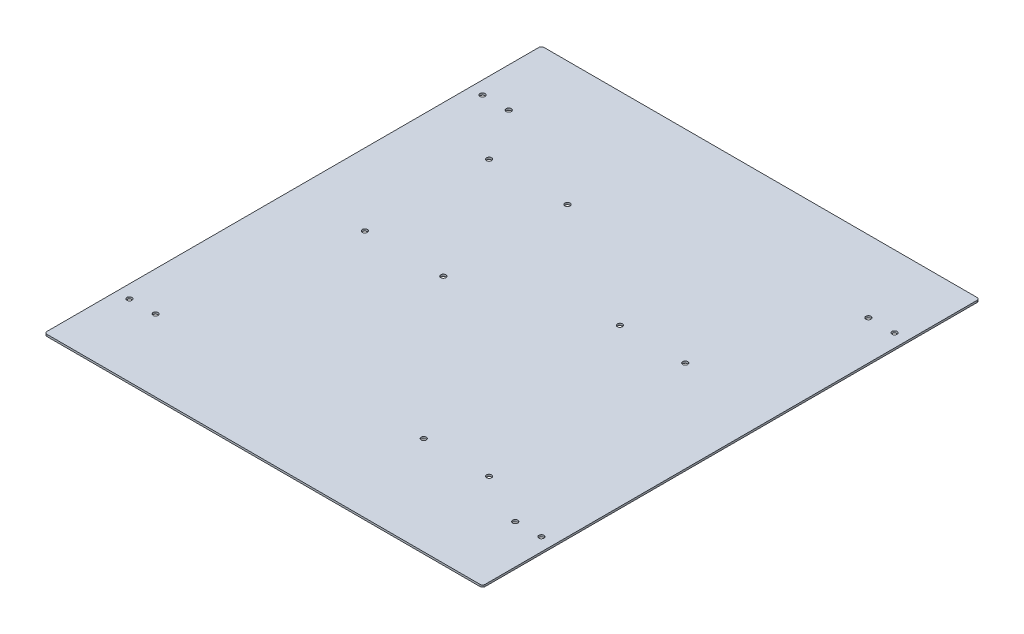
ISO-10303-21;
HEADER;
FILE_DESCRIPTION(('STEP AP214'),'2;1');
FILE_NAME('part.step','',(''),(''),'','','');
FILE_SCHEMA(('AUTOMOTIVE_DESIGN { 1 0 10303 214 1 1 1 1 }'));
ENDSEC;
DATA;
#1=APPLICATION_CONTEXT('core data for automotive mechanical design processes');
#2=APPLICATION_PROTOCOL_DEFINITION('international standard','automotive_design',2000,#1);
#3=PRODUCT_CONTEXT('',#1,'mechanical');
#4=PRODUCT('Part','Part','',(#3));
#5=PRODUCT_RELATED_PRODUCT_CATEGORY('part','',(#4));
#6=PRODUCT_DEFINITION_FORMATION('','',#4);
#7=PRODUCT_DEFINITION_CONTEXT('part definition',#1,'design');
#8=PRODUCT_DEFINITION('design','',#6,#7);
#9=PRODUCT_DEFINITION_SHAPE('','',#8);
#10=(LENGTH_UNIT() NAMED_UNIT(*) SI_UNIT(.MILLI.,.METRE.));
#11=(NAMED_UNIT(*) PLANE_ANGLE_UNIT() SI_UNIT($,.RADIAN.));
#12=(NAMED_UNIT(*) SI_UNIT($,.STERADIAN.) SOLID_ANGLE_UNIT());
#13=UNCERTAINTY_MEASURE_WITH_UNIT(LENGTH_MEASURE(1.E-05),#10,'distance_accuracy_value','');
#14=(GEOMETRIC_REPRESENTATION_CONTEXT(3) GLOBAL_UNCERTAINTY_ASSIGNED_CONTEXT((#13)) GLOBAL_UNIT_ASSIGNED_CONTEXT((#10,
#11,#12)) REPRESENTATION_CONTEXT('',''));
#15=CARTESIAN_POINT('',(0.,0.,0.));
#16=DIRECTION('',(0.,0.,1.));
#17=DIRECTION('',(1.,0.,0.));
#18=AXIS2_PLACEMENT_3D('',#15,#16,#17);
#19=CARTESIAN_POINT('',(167.5,1.5,190.));
#20=DIRECTION('',(-1.,0.,0.));
#21=DIRECTION('',(0.,0.,1.));
#22=AXIS2_PLACEMENT_3D('',#19,#20,#21);
#23=PLANE('',#22);
#24=DIRECTION('',(0.,0.,-1.));
#25=VECTOR('',#24,1.);
#26=CARTESIAN_POINT('',(167.5,0.,190.));
#27=LINE('',#26,#25);
#28=CARTESIAN_POINT('',(167.5,0.,188.));
#29=VERTEX_POINT('',#28);
#30=CARTESIAN_POINT('',(167.5,0.,-188.));
#31=VERTEX_POINT('',#30);
#32=EDGE_CURVE('E128',#29,#31,#27,.T.);
#33=ORIENTED_EDGE('',*,*,#32,.T.);
#34=DIRECTION('',(0.,-1.,0.));
#35=VECTOR('',#34,1.);
#36=CARTESIAN_POINT('',(167.5,1.5,-188.));
#37=LINE('',#36,#35);
#38=CARTESIAN_POINT('',(167.5,1.5,-188.));
#39=VERTEX_POINT('',#38);
#40=EDGE_CURVE('E106',#31,#39,#37,.F.);
#41=ORIENTED_EDGE('',*,*,#40,.T.);
#42=DIRECTION('',(0.,0.,-1.));
#43=VECTOR('',#42,1.);
#44=CARTESIAN_POINT('',(167.5,1.5,190.));
#45=LINE('',#44,#43);
#46=CARTESIAN_POINT('',(167.5,1.5,188.));
#47=VERTEX_POINT('',#46);
#48=EDGE_CURVE('E138',#47,#39,#45,.T.);
#49=ORIENTED_EDGE('',*,*,#48,.F.);
#50=DIRECTION('',(0.,-1.,0.));
#51=VECTOR('',#50,1.);
#52=CARTESIAN_POINT('',(167.5,1.5,188.));
#53=LINE('',#52,#51);
#54=EDGE_CURVE('E111',#47,#29,#53,.T.);
#55=ORIENTED_EDGE('',*,*,#54,.T.);
#56=EDGE_LOOP('',(#33,#41,#49,#55));
#57=FACE_BOUND('',#56,.T.);
#58=ADVANCED_FACE('F35',(#57),#23,.F.);
#59=CARTESIAN_POINT('',(-167.5,1.5,-190.));
#60=DIRECTION('',(0.,0.,1.));
#61=DIRECTION('',(1.,0.,0.));
#62=AXIS2_PLACEMENT_3D('',#59,#60,#61);
#63=PLANE('',#62);
#64=DIRECTION('',(-1.,0.,0.));
#65=VECTOR('',#64,1.);
#66=CARTESIAN_POINT('',(-167.5,1.5,-190.));
#67=LINE('',#66,#65);
#68=CARTESIAN_POINT('',(165.5,1.5,-190.));
#69=VERTEX_POINT('',#68);
#70=CARTESIAN_POINT('',(-165.5,1.5,-190.));
#71=VERTEX_POINT('',#70);
#72=EDGE_CURVE('E121',#69,#71,#67,.T.);
#73=ORIENTED_EDGE('',*,*,#72,.F.);
#74=DIRECTION('',(0.,-1.,0.));
#75=VECTOR('',#74,1.);
#76=CARTESIAN_POINT('',(165.5,1.5,-190.));
#77=LINE('',#76,#75);
#78=CARTESIAN_POINT('',(165.5,0.,-190.));
#79=VERTEX_POINT('',#78);
#80=EDGE_CURVE('E105',#69,#79,#77,.T.);
#81=ORIENTED_EDGE('',*,*,#80,.T.);
#82=DIRECTION('',(-1.,0.,0.));
#83=VECTOR('',#82,1.);
#84=CARTESIAN_POINT('',(-167.5,0.,-190.));
#85=LINE('',#84,#83);
#86=CARTESIAN_POINT('',(-165.5,0.,-190.));
#87=VERTEX_POINT('',#86);
#88=EDGE_CURVE('E118',#79,#87,#85,.T.);
#89=ORIENTED_EDGE('',*,*,#88,.T.);
#90=DIRECTION('',(0.,-1.,0.));
#91=VECTOR('',#90,1.);
#92=CARTESIAN_POINT('',(-165.5,1.5,-190.));
#93=LINE('',#92,#91);
#94=EDGE_CURVE('E123',#87,#71,#93,.F.);
#95=ORIENTED_EDGE('',*,*,#94,.T.);
#96=EDGE_LOOP('',(#73,#81,#89,#95));
#97=FACE_BOUND('',#96,.T.);
#98=ADVANCED_FACE('F117',(#97),#63,.F.);
#99=CARTESIAN_POINT('',(-167.5,1.5,190.));
#100=DIRECTION('',(1.,0.,0.));
#101=DIRECTION('',(0.,0.,-1.));
#102=AXIS2_PLACEMENT_3D('',#99,#100,#101);
#103=PLANE('',#102);
#104=DIRECTION('',(0.,0.,1.));
#105=VECTOR('',#104,1.);
#106=CARTESIAN_POINT('',(-167.5,0.,190.));
#107=LINE('',#106,#105);
#108=CARTESIAN_POINT('',(-167.5,0.,-188.));
#109=VERTEX_POINT('',#108);
#110=CARTESIAN_POINT('',(-167.5,0.,188.));
#111=VERTEX_POINT('',#110);
#112=EDGE_CURVE('E127',#109,#111,#107,.T.);
#113=ORIENTED_EDGE('',*,*,#112,.T.);
#114=DIRECTION('',(0.,-1.,0.));
#115=VECTOR('',#114,1.);
#116=CARTESIAN_POINT('',(-167.5,1.5,188.));
#117=LINE('',#116,#115);
#118=CARTESIAN_POINT('',(-167.5,1.5,188.));
#119=VERTEX_POINT('',#118);
#120=EDGE_CURVE('E11',#111,#119,#117,.F.);
#121=ORIENTED_EDGE('',*,*,#120,.T.);
#122=DIRECTION('',(0.,0.,1.));
#123=VECTOR('',#122,1.);
#124=CARTESIAN_POINT('',(-167.5,1.5,190.));
#125=LINE('',#124,#123);
#126=CARTESIAN_POINT('',(-167.5,1.5,-188.));
#127=VERTEX_POINT('',#126);
#128=EDGE_CURVE('E192',#127,#119,#125,.T.);
#129=ORIENTED_EDGE('',*,*,#128,.F.);
#130=DIRECTION('',(0.,-1.,0.));
#131=VECTOR('',#130,1.);
#132=CARTESIAN_POINT('',(-167.5,1.5,-188.));
#133=LINE('',#132,#131);
#134=EDGE_CURVE('E43',#127,#109,#133,.T.);
#135=ORIENTED_EDGE('',*,*,#134,.T.);
#136=EDGE_LOOP('',(#113,#121,#129,#135));
#137=FACE_BOUND('',#136,.T.);
#138=ADVANCED_FACE('F190',(#137),#103,.F.);
#139=CARTESIAN_POINT('',(-167.5,1.5,190.));
#140=DIRECTION('',(0.,0.,-1.));
#141=DIRECTION('',(-1.,0.,0.));
#142=AXIS2_PLACEMENT_3D('',#139,#140,#141);
#143=PLANE('',#142);
#144=DIRECTION('',(1.,0.,0.));
#145=VECTOR('',#144,1.);
#146=CARTESIAN_POINT('',(-167.5,0.,190.));
#147=LINE('',#146,#145);
#148=CARTESIAN_POINT('',(-165.5,0.,190.));
#149=VERTEX_POINT('',#148);
#150=CARTESIAN_POINT('',(165.5,0.,190.));
#151=VERTEX_POINT('',#150);
#152=EDGE_CURVE('E131',#149,#151,#147,.T.);
#153=ORIENTED_EDGE('',*,*,#152,.T.);
#154=DIRECTION('',(0.,-1.,0.));
#155=VECTOR('',#154,1.);
#156=CARTESIAN_POINT('',(165.5,1.5,190.));
#157=LINE('',#156,#155);
#158=CARTESIAN_POINT('',(165.5,1.5,190.));
#159=VERTEX_POINT('',#158);
#160=EDGE_CURVE('E50',#151,#159,#157,.F.);
#161=ORIENTED_EDGE('',*,*,#160,.T.);
#162=DIRECTION('',(1.,0.,0.));
#163=VECTOR('',#162,1.);
#164=CARTESIAN_POINT('',(-167.5,1.5,190.));
#165=LINE('',#164,#163);
#166=CARTESIAN_POINT('',(-165.5,1.5,190.));
#167=VERTEX_POINT('',#166);
#168=EDGE_CURVE('E167',#167,#159,#165,.T.);
#169=ORIENTED_EDGE('',*,*,#168,.F.);
#170=DIRECTION('',(0.,-1.,0.));
#171=VECTOR('',#170,1.);
#172=CARTESIAN_POINT('',(-165.5,1.5,190.));
#173=LINE('',#172,#171);
#174=EDGE_CURVE('E183',#167,#149,#173,.T.);
#175=ORIENTED_EDGE('',*,*,#174,.T.);
#176=EDGE_LOOP('',(#153,#161,#169,#175));
#177=FACE_BOUND('',#176,.T.);
#178=ADVANCED_FACE('F199',(#177),#143,.F.);
#179=CARTESIAN_POINT('',(0.,1.5,0.));
#180=DIRECTION('',(0.,-1.,0.));
#181=DIRECTION('',(0.,0.,-1.));
#182=AXIS2_PLACEMENT_3D('',#179,#180,#181);
#183=PLANE('',#182);
#184=CARTESIAN_POINT('',(-112.5,1.5,0.));
#185=DIRECTION('',(0.,1.,0.));
#186=DIRECTION('',(0.,0.,1.));
#187=AXIS2_PLACEMENT_3D('',#184,#185,#186);
#188=CIRCLE('',#187,1.95);
#189=CARTESIAN_POINT('',(-112.5,1.5,1.94999999999998));
#190=VERTEX_POINT('',#189);
#191=EDGE_CURVE('E265',#190,#190,#188,.T.);
#192=ORIENTED_EDGE('',*,*,#191,.F.);
#193=EDGE_LOOP('',(#192));
#194=FACE_BOUND('',#193,.T.);
#195=CARTESIAN_POINT('',(-52.5,1.5,0.));
#196=DIRECTION('',(0.,1.,0.));
#197=DIRECTION('',(0.,0.,1.));
#198=AXIS2_PLACEMENT_3D('',#195,#196,#197);
#199=CIRCLE('',#198,1.95);
#200=CARTESIAN_POINT('',(-52.5,1.5,1.94999999999999));
#201=VERTEX_POINT('',#200);
#202=EDGE_CURVE('E268',#201,#201,#199,.T.);
#203=ORIENTED_EDGE('',*,*,#202,.F.);
#204=EDGE_LOOP('',(#203));
#205=FACE_BOUND('',#204,.T.);
#206=CARTESIAN_POINT('',(-52.5,1.5,-95.));
#207=DIRECTION('',(0.,1.,0.));
#208=DIRECTION('',(0.,0.,1.));
#209=AXIS2_PLACEMENT_3D('',#206,#207,#208);
#210=CIRCLE('',#209,1.95);
#211=CARTESIAN_POINT('',(-52.5,1.5,-93.05));
#212=VERTEX_POINT('',#211);
#213=EDGE_CURVE('E264',#212,#212,#210,.T.);
#214=ORIENTED_EDGE('',*,*,#213,.F.);
#215=EDGE_LOOP('',(#214));
#216=FACE_BOUND('',#215,.T.);
#217=CARTESIAN_POINT('',(-112.5,1.5,-95.));
#218=DIRECTION('',(0.,1.,0.));
#219=DIRECTION('',(0.,0.,1.));
#220=AXIS2_PLACEMENT_3D('',#217,#218,#219);
#221=CIRCLE('',#220,1.95);
#222=CARTESIAN_POINT('',(-112.5,1.5,-93.05));
#223=VERTEX_POINT('',#222);
#224=EDGE_CURVE('E157',#223,#223,#221,.T.);
#225=ORIENTED_EDGE('',*,*,#224,.F.);
#226=EDGE_LOOP('',(#225));
#227=FACE_BOUND('',#226,.T.);
#228=CARTESIAN_POINT('',(47.5,1.5,-35.0000000000002));
#229=DIRECTION('',(0.,1.,0.));
#230=DIRECTION('',(0.,0.,1.));
#231=AXIS2_PLACEMENT_3D('',#228,#229,#230);
#232=CIRCLE('',#231,1.95);
#233=CARTESIAN_POINT('',(47.5,1.5,-33.0500000000002));
#234=VERTEX_POINT('',#233);
#235=EDGE_CURVE('E254',#234,#234,#232,.T.);
#236=ORIENTED_EDGE('',*,*,#235,.F.);
#237=EDGE_LOOP('',(#236));
#238=FACE_BOUND('',#237,.T.);
#239=CARTESIAN_POINT('',(97.5,1.5,115.));
#240=DIRECTION('',(0.,1.,0.));
#241=DIRECTION('',(0.,0.,1.));
#242=AXIS2_PLACEMENT_3D('',#239,#240,#241);
#243=CIRCLE('',#242,1.95000000000003);
#244=CARTESIAN_POINT('',(97.5,1.5,116.95));
#245=VERTEX_POINT('',#244);
#246=EDGE_CURVE('E255',#245,#245,#243,.T.);
#247=ORIENTED_EDGE('',*,*,#246,.F.);
#248=EDGE_LOOP('',(#247));
#249=FACE_BOUND('',#248,.T.);
#250=CARTESIAN_POINT('',(47.5,1.5,115.));
#251=DIRECTION('',(0.,1.,0.));
#252=DIRECTION('',(0.,0.,1.));
#253=AXIS2_PLACEMENT_3D('',#250,#251,#252);
#254=CIRCLE('',#253,1.95);
#255=CARTESIAN_POINT('',(47.5,1.5,116.95));
#256=VERTEX_POINT('',#255);
#257=EDGE_CURVE('E166',#256,#256,#254,.T.);
#258=ORIENTED_EDGE('',*,*,#257,.F.);
#259=EDGE_LOOP('',(#258));
#260=FACE_BOUND('',#259,.T.);
#261=CARTESIAN_POINT('',(97.5,1.5,-35.0000000000002));
#262=DIRECTION('',(0.,1.,0.));
#263=DIRECTION('',(0.,0.,1.));
#264=AXIS2_PLACEMENT_3D('',#261,#262,#263);
#265=CIRCLE('',#264,1.95);
#266=CARTESIAN_POINT('',(97.5,1.5,-33.0500000000002));
#267=VERTEX_POINT('',#266);
#268=EDGE_CURVE('E143',#267,#267,#265,.T.);
#269=ORIENTED_EDGE('',*,*,#268,.F.);
#270=EDGE_LOOP('',(#269));
#271=FACE_BOUND('',#270,.T.);
#272=CARTESIAN_POINT('',(157.5,1.5,-135.));
#273=DIRECTION('',(0.,-1.,0.));
#274=DIRECTION('',(0.,0.,-1.));
#275=AXIS2_PLACEMENT_3D('',#272,#273,#274);
#276=CIRCLE('',#275,1.95);
#277=CARTESIAN_POINT('',(157.5,1.5,-136.95));
#278=VERTEX_POINT('',#277);
#279=EDGE_CURVE('E133',#278,#278,#276,.T.);
#280=ORIENTED_EDGE('',*,*,#279,.T.);
#281=EDGE_LOOP('',(#280));
#282=FACE_BOUND('',#281,.T.);
#283=CARTESIAN_POINT('',(137.5,1.5,-135.));
#284=DIRECTION('',(0.,-1.,0.));
#285=DIRECTION('',(0.,0.,-1.));
#286=AXIS2_PLACEMENT_3D('',#283,#284,#285);
#287=CIRCLE('',#286,1.95);
#288=CARTESIAN_POINT('',(137.5,1.5,-136.95));
#289=VERTEX_POINT('',#288);
#290=EDGE_CURVE('E208',#289,#289,#287,.T.);
#291=ORIENTED_EDGE('',*,*,#290,.T.);
#292=EDGE_LOOP('',(#291));
#293=FACE_BOUND('',#292,.T.);
#294=CARTESIAN_POINT('',(157.5,1.5,135.));
#295=DIRECTION('',(0.,-1.,0.));
#296=DIRECTION('',(0.,0.,-1.));
#297=AXIS2_PLACEMENT_3D('',#294,#295,#296);
#298=CIRCLE('',#297,1.95);
#299=CARTESIAN_POINT('',(157.5,1.5,133.05));
#300=VERTEX_POINT('',#299);
#301=EDGE_CURVE('E211',#300,#300,#298,.T.);
#302=ORIENTED_EDGE('',*,*,#301,.T.);
#303=EDGE_LOOP('',(#302));
#304=FACE_BOUND('',#303,.T.);
#305=CARTESIAN_POINT('',(-157.5,1.5,135.));
#306=DIRECTION('',(0.,-1.,0.));
#307=DIRECTION('',(0.,0.,-1.));
#308=AXIS2_PLACEMENT_3D('',#305,#306,#307);
#309=CIRCLE('',#308,1.95);
#310=CARTESIAN_POINT('',(-157.5,1.5,133.05));
#311=VERTEX_POINT('',#310);
#312=EDGE_CURVE('E214',#311,#311,#309,.T.);
#313=ORIENTED_EDGE('',*,*,#312,.T.);
#314=EDGE_LOOP('',(#313));
#315=FACE_BOUND('',#314,.T.);
#316=CARTESIAN_POINT('',(-137.5,1.5,-135.));
#317=DIRECTION('',(0.,-1.,0.));
#318=DIRECTION('',(0.,0.,-1.));
#319=AXIS2_PLACEMENT_3D('',#316,#317,#318);
#320=CIRCLE('',#319,1.95);
#321=CARTESIAN_POINT('',(-137.5,1.5,-136.95));
#322=VERTEX_POINT('',#321);
#323=EDGE_CURVE('E217',#322,#322,#320,.T.);
#324=ORIENTED_EDGE('',*,*,#323,.T.);
#325=EDGE_LOOP('',(#324));
#326=FACE_BOUND('',#325,.T.);
#327=CARTESIAN_POINT('',(-157.5,1.5,-135.));
#328=DIRECTION('',(0.,-1.,0.));
#329=DIRECTION('',(0.,0.,-1.));
#330=AXIS2_PLACEMENT_3D('',#327,#328,#329);
#331=CIRCLE('',#330,1.95);
#332=CARTESIAN_POINT('',(-157.5,1.5,-136.95));
#333=VERTEX_POINT('',#332);
#334=EDGE_CURVE('E220',#333,#333,#331,.T.);
#335=ORIENTED_EDGE('',*,*,#334,.T.);
#336=EDGE_LOOP('',(#335));
#337=FACE_BOUND('',#336,.T.);
#338=CARTESIAN_POINT('',(-137.5,1.5,135.));
#339=DIRECTION('',(0.,-1.,0.));
#340=DIRECTION('',(0.,0.,-1.));
#341=AXIS2_PLACEMENT_3D('',#338,#339,#340);
#342=CIRCLE('',#341,1.95);
#343=CARTESIAN_POINT('',(-137.5,1.5,133.05));
#344=VERTEX_POINT('',#343);
#345=EDGE_CURVE('E223',#344,#344,#342,.T.);
#346=ORIENTED_EDGE('',*,*,#345,.T.);
#347=EDGE_LOOP('',(#346));
#348=FACE_BOUND('',#347,.T.);
#349=CARTESIAN_POINT('',(137.5,1.5,135.));
#350=DIRECTION('',(0.,-1.,0.));
#351=DIRECTION('',(0.,0.,-1.));
#352=AXIS2_PLACEMENT_3D('',#349,#350,#351);
#353=CIRCLE('',#352,1.95);
#354=CARTESIAN_POINT('',(137.5,1.5,133.05));
#355=VERTEX_POINT('',#354);
#356=EDGE_CURVE('E226',#355,#355,#353,.T.);
#357=ORIENTED_EDGE('',*,*,#356,.T.);
#358=EDGE_LOOP('',(#357));
#359=FACE_BOUND('',#358,.T.);
#360=ORIENTED_EDGE('',*,*,#48,.T.);
#361=CARTESIAN_POINT('',(165.5,1.5,-188.));
#362=DIRECTION('',(0.,-1.,0.));
#363=DIRECTION('',(0.,0.,-1.));
#364=AXIS2_PLACEMENT_3D('',#361,#362,#363);
#365=CIRCLE('',#364,2.);
#366=EDGE_CURVE('E181',#39,#69,#365,.F.);
#367=ORIENTED_EDGE('',*,*,#366,.T.);
#368=ORIENTED_EDGE('',*,*,#72,.T.);
#369=CARTESIAN_POINT('',(-165.5,1.5,-188.));
#370=DIRECTION('',(0.,-1.,0.));
#371=DIRECTION('',(0.,0.,-1.));
#372=AXIS2_PLACEMENT_3D('',#369,#370,#371);
#373=CIRCLE('',#372,2.);
#374=EDGE_CURVE('E176',#71,#127,#373,.F.);
#375=ORIENTED_EDGE('',*,*,#374,.T.);
#376=ORIENTED_EDGE('',*,*,#128,.T.);
#377=CARTESIAN_POINT('',(-165.5,1.5,188.));
#378=DIRECTION('',(0.,-1.,0.));
#379=DIRECTION('',(0.,0.,-1.));
#380=AXIS2_PLACEMENT_3D('',#377,#378,#379);
#381=CIRCLE('',#380,2.);
#382=EDGE_CURVE('E57',#119,#167,#381,.F.);
#383=ORIENTED_EDGE('',*,*,#382,.T.);
#384=ORIENTED_EDGE('',*,*,#168,.T.);
#385=CARTESIAN_POINT('',(165.5,1.5,188.));
#386=DIRECTION('',(0.,-1.,0.));
#387=DIRECTION('',(0.,0.,-1.));
#388=AXIS2_PLACEMENT_3D('',#385,#386,#387);
#389=CIRCLE('',#388,2.);
#390=EDGE_CURVE('E179',#159,#47,#389,.F.);
#391=ORIENTED_EDGE('',*,*,#390,.T.);
#392=EDGE_LOOP('',(#360,#367,#368,#375,#376,#383,#384,#391));
#393=FACE_BOUND('',#392,.T.);
#394=ADVANCED_FACE('F276',(#194,#205,#216,#227,#238,#249,#260,#271,#282,#293,#304,#315,#326,
#337,#348,#359,#393),#183,.F.);
#395=CARTESIAN_POINT('',(0.,0.,0.));
#396=DIRECTION('',(0.,-1.,0.));
#397=DIRECTION('',(0.,0.,-1.));
#398=AXIS2_PLACEMENT_3D('',#395,#396,#397);
#399=PLANE('',#398);
#400=CARTESIAN_POINT('',(-112.5,0.,0.));
#401=DIRECTION('',(0.,-1.,0.));
#402=DIRECTION('',(0.,0.,-1.));
#403=AXIS2_PLACEMENT_3D('',#400,#401,#402);
#404=CIRCLE('',#403,1.95);
#405=CARTESIAN_POINT('',(-112.5,0.,-1.95000000000001));
#406=VERTEX_POINT('',#405);
#407=EDGE_CURVE('E163',#406,#406,#404,.T.);
#408=ORIENTED_EDGE('',*,*,#407,.F.);
#409=EDGE_LOOP('',(#408));
#410=FACE_BOUND('',#409,.T.);
#411=CARTESIAN_POINT('',(-52.5,0.,0.));
#412=DIRECTION('',(0.,-1.,0.));
#413=DIRECTION('',(0.,0.,-1.));
#414=AXIS2_PLACEMENT_3D('',#411,#412,#413);
#415=CIRCLE('',#414,1.95);
#416=CARTESIAN_POINT('',(-52.5,0.,-1.95000000000001));
#417=VERTEX_POINT('',#416);
#418=EDGE_CURVE('E160',#417,#417,#415,.T.);
#419=ORIENTED_EDGE('',*,*,#418,.F.);
#420=EDGE_LOOP('',(#419));
#421=FACE_BOUND('',#420,.T.);
#422=CARTESIAN_POINT('',(-52.5,0.,-95.));
#423=DIRECTION('',(0.,-1.,0.));
#424=DIRECTION('',(0.,0.,-1.));
#425=AXIS2_PLACEMENT_3D('',#422,#423,#424);
#426=CIRCLE('',#425,1.95);
#427=CARTESIAN_POINT('',(-52.5,0.,-96.95));
#428=VERTEX_POINT('',#427);
#429=EDGE_CURVE('E156',#428,#428,#426,.T.);
#430=ORIENTED_EDGE('',*,*,#429,.F.);
#431=EDGE_LOOP('',(#430));
#432=FACE_BOUND('',#431,.T.);
#433=CARTESIAN_POINT('',(-112.5,0.,-95.));
#434=DIRECTION('',(0.,-1.,0.));
#435=DIRECTION('',(0.,0.,-1.));
#436=AXIS2_PLACEMENT_3D('',#433,#434,#435);
#437=CIRCLE('',#436,1.95);
#438=CARTESIAN_POINT('',(-112.5,0.,-96.95));
#439=VERTEX_POINT('',#438);
#440=EDGE_CURVE('E153',#439,#439,#437,.T.);
#441=ORIENTED_EDGE('',*,*,#440,.F.);
#442=EDGE_LOOP('',(#441));
#443=FACE_BOUND('',#442,.T.);
#444=CARTESIAN_POINT('',(47.5,0.,-35.0000000000002));
#445=DIRECTION('',(0.,-1.,0.));
#446=DIRECTION('',(0.,0.,-1.));
#447=AXIS2_PLACEMENT_3D('',#444,#445,#446);
#448=CIRCLE('',#447,1.95);
#449=CARTESIAN_POINT('',(47.5,0.,-36.9500000000002));
#450=VERTEX_POINT('',#449);
#451=EDGE_CURVE('E149',#450,#450,#448,.T.);
#452=ORIENTED_EDGE('',*,*,#451,.F.);
#453=EDGE_LOOP('',(#452));
#454=FACE_BOUND('',#453,.T.);
#455=CARTESIAN_POINT('',(97.5,0.,115.));
#456=DIRECTION('',(0.,-1.,0.));
#457=DIRECTION('',(0.,0.,-1.));
#458=AXIS2_PLACEMENT_3D('',#455,#456,#457);
#459=CIRCLE('',#458,1.95000000000003);
#460=CARTESIAN_POINT('',(97.5,0.,113.05));
#461=VERTEX_POINT('',#460);
#462=EDGE_CURVE('E146',#461,#461,#459,.T.);
#463=ORIENTED_EDGE('',*,*,#462,.F.);
#464=EDGE_LOOP('',(#463));
#465=FACE_BOUND('',#464,.T.);
#466=CARTESIAN_POINT('',(47.5,0.,115.));
#467=DIRECTION('',(0.,-1.,0.));
#468=DIRECTION('',(0.,0.,-1.));
#469=AXIS2_PLACEMENT_3D('',#466,#467,#468);
#470=CIRCLE('',#469,1.95);
#471=CARTESIAN_POINT('',(47.5,0.,113.05));
#472=VERTEX_POINT('',#471);
#473=EDGE_CURVE('E142',#472,#472,#470,.T.);
#474=ORIENTED_EDGE('',*,*,#473,.F.);
#475=EDGE_LOOP('',(#474));
#476=FACE_BOUND('',#475,.T.);
#477=CARTESIAN_POINT('',(97.5,0.,-35.0000000000002));
#478=DIRECTION('',(0.,-1.,0.));
#479=DIRECTION('',(0.,0.,-1.));
#480=AXIS2_PLACEMENT_3D('',#477,#478,#479);
#481=CIRCLE('',#480,1.95);
#482=CARTESIAN_POINT('',(97.5,0.,-36.9500000000002));
#483=VERTEX_POINT('',#482);
#484=EDGE_CURVE('E139',#483,#483,#481,.T.);
#485=ORIENTED_EDGE('',*,*,#484,.F.);
#486=EDGE_LOOP('',(#485));
#487=FACE_BOUND('',#486,.T.);
#488=CARTESIAN_POINT('',(157.5,0.,-135.));
#489=DIRECTION('',(0.,-1.,0.));
#490=DIRECTION('',(0.,0.,-1.));
#491=AXIS2_PLACEMENT_3D('',#488,#489,#490);
#492=CIRCLE('',#491,1.95);
#493=CARTESIAN_POINT('',(157.5,0.,-136.95));
#494=VERTEX_POINT('',#493);
#495=EDGE_CURVE('E232',#494,#494,#492,.T.);
#496=ORIENTED_EDGE('',*,*,#495,.F.);
#497=EDGE_LOOP('',(#496));
#498=FACE_BOUND('',#497,.T.);
#499=CARTESIAN_POINT('',(137.5,0.,-135.));
#500=DIRECTION('',(0.,-1.,0.));
#501=DIRECTION('',(0.,0.,-1.));
#502=AXIS2_PLACEMENT_3D('',#499,#500,#501);
#503=CIRCLE('',#502,1.95);
#504=CARTESIAN_POINT('',(137.5,0.,-136.95));
#505=VERTEX_POINT('',#504);
#506=EDGE_CURVE('E240',#505,#505,#503,.T.);
#507=ORIENTED_EDGE('',*,*,#506,.F.);
#508=EDGE_LOOP('',(#507));
#509=FACE_BOUND('',#508,.T.);
#510=CARTESIAN_POINT('',(157.5,0.,135.));
#511=DIRECTION('',(0.,-1.,0.));
#512=DIRECTION('',(0.,0.,-1.));
#513=AXIS2_PLACEMENT_3D('',#510,#511,#512);
#514=CIRCLE('',#513,1.95);
#515=CARTESIAN_POINT('',(157.5,0.,133.05));
#516=VERTEX_POINT('',#515);
#517=EDGE_CURVE('E236',#516,#516,#514,.T.);
#518=ORIENTED_EDGE('',*,*,#517,.F.);
#519=EDGE_LOOP('',(#518));
#520=FACE_BOUND('',#519,.T.);
#521=CARTESIAN_POINT('',(-157.5,0.,135.));
#522=DIRECTION('',(0.,-1.,0.));
#523=DIRECTION('',(0.,0.,-1.));
#524=AXIS2_PLACEMENT_3D('',#521,#522,#523);
#525=CIRCLE('',#524,1.95);
#526=CARTESIAN_POINT('',(-157.5,0.,133.05));
#527=VERTEX_POINT('',#526);
#528=EDGE_CURVE('E233',#527,#527,#525,.T.);
#529=ORIENTED_EDGE('',*,*,#528,.F.);
#530=EDGE_LOOP('',(#529));
#531=FACE_BOUND('',#530,.T.);
#532=CARTESIAN_POINT('',(-137.5,0.,-135.));
#533=DIRECTION('',(0.,-1.,0.));
#534=DIRECTION('',(0.,0.,-1.));
#535=AXIS2_PLACEMENT_3D('',#532,#533,#534);
#536=CIRCLE('',#535,1.95);
#537=CARTESIAN_POINT('',(-137.5,0.,-136.95));
#538=VERTEX_POINT('',#537);
#539=EDGE_CURVE('E237',#538,#538,#536,.T.);
#540=ORIENTED_EDGE('',*,*,#539,.F.);
#541=EDGE_LOOP('',(#540));
#542=FACE_BOUND('',#541,.T.);
#543=CARTESIAN_POINT('',(-157.5,0.,-135.));
#544=DIRECTION('',(0.,-1.,0.));
#545=DIRECTION('',(0.,0.,-1.));
#546=AXIS2_PLACEMENT_3D('',#543,#544,#545);
#547=CIRCLE('',#546,1.95);
#548=CARTESIAN_POINT('',(-157.5,0.,-136.95));
#549=VERTEX_POINT('',#548);
#550=EDGE_CURVE('E247',#549,#549,#547,.T.);
#551=ORIENTED_EDGE('',*,*,#550,.F.);
#552=EDGE_LOOP('',(#551));
#553=FACE_BOUND('',#552,.T.);
#554=CARTESIAN_POINT('',(-137.5,0.,135.));
#555=DIRECTION('',(0.,-1.,0.));
#556=DIRECTION('',(0.,0.,-1.));
#557=AXIS2_PLACEMENT_3D('',#554,#555,#556);
#558=CIRCLE('',#557,1.95);
#559=CARTESIAN_POINT('',(-137.5,0.,133.05));
#560=VERTEX_POINT('',#559);
#561=EDGE_CURVE('E152',#560,#560,#558,.T.);
#562=ORIENTED_EDGE('',*,*,#561,.F.);
#563=EDGE_LOOP('',(#562));
#564=FACE_BOUND('',#563,.T.);
#565=CARTESIAN_POINT('',(137.5,0.,135.));
#566=DIRECTION('',(0.,-1.,0.));
#567=DIRECTION('',(0.,0.,-1.));
#568=AXIS2_PLACEMENT_3D('',#565,#566,#567);
#569=CIRCLE('',#568,1.95);
#570=CARTESIAN_POINT('',(137.5,0.,133.05));
#571=VERTEX_POINT('',#570);
#572=EDGE_CURVE('E229',#571,#571,#569,.T.);
#573=ORIENTED_EDGE('',*,*,#572,.F.);
#574=EDGE_LOOP('',(#573));
#575=FACE_BOUND('',#574,.T.);
#576=ORIENTED_EDGE('',*,*,#88,.F.);
#577=CARTESIAN_POINT('',(165.5,0.,-188.));
#578=DIRECTION('',(0.,-1.,0.));
#579=DIRECTION('',(0.,0.,-1.));
#580=AXIS2_PLACEMENT_3D('',#577,#578,#579);
#581=CIRCLE('',#580,2.);
#582=EDGE_CURVE('E101',#79,#31,#581,.T.);
#583=ORIENTED_EDGE('',*,*,#582,.T.);
#584=ORIENTED_EDGE('',*,*,#32,.F.);
#585=CARTESIAN_POINT('',(165.5,0.,188.));
#586=DIRECTION('',(0.,-1.,0.));
#587=DIRECTION('',(0.,0.,-1.));
#588=AXIS2_PLACEMENT_3D('',#585,#586,#587);
#589=CIRCLE('',#588,2.);
#590=EDGE_CURVE('E112',#29,#151,#589,.T.);
#591=ORIENTED_EDGE('',*,*,#590,.T.);
#592=ORIENTED_EDGE('',*,*,#152,.F.);
#593=CARTESIAN_POINT('',(-165.5,0.,188.));
#594=DIRECTION('',(0.,-1.,0.));
#595=DIRECTION('',(0.,0.,-1.));
#596=AXIS2_PLACEMENT_3D('',#593,#594,#595);
#597=CIRCLE('',#596,2.);
#598=EDGE_CURVE('E170',#149,#111,#597,.T.);
#599=ORIENTED_EDGE('',*,*,#598,.T.);
#600=ORIENTED_EDGE('',*,*,#112,.F.);
#601=CARTESIAN_POINT('',(-165.5,0.,-188.));
#602=DIRECTION('',(0.,-1.,0.));
#603=DIRECTION('',(0.,0.,-1.));
#604=AXIS2_PLACEMENT_3D('',#601,#602,#603);
#605=CIRCLE('',#604,2.);
#606=EDGE_CURVE('E122',#109,#87,#605,.T.);
#607=ORIENTED_EDGE('',*,*,#606,.T.);
#608=EDGE_LOOP('',(#576,#583,#584,#591,#592,#599,#600,#607));
#609=FACE_BOUND('',#608,.T.);
#610=ADVANCED_FACE('F125',(#410,#421,#432,#443,#454,#465,#476,#487,#498,#509,#520,#531,#542,
#553,#564,#575,#609),#399,.T.);
#611=CARTESIAN_POINT('',(137.5,50.8,135.));
#612=DIRECTION('',(0.,-1.,0.));
#613=DIRECTION('',(0.,0.,-1.));
#614=AXIS2_PLACEMENT_3D('',#611,#612,#613);
#615=CYLINDRICAL_SURFACE('',#614,1.95);
#616=ORIENTED_EDGE('',*,*,#572,.T.);
#617=EDGE_LOOP('',(#616));
#618=FACE_BOUND('',#617,.T.);
#619=ORIENTED_EDGE('',*,*,#356,.F.);
#620=EDGE_LOOP('',(#619));
#621=FACE_BOUND('',#620,.T.);
#622=ADVANCED_FACE('F331',(#618,#621),#615,.F.);
#623=CARTESIAN_POINT('',(-137.5,50.8,135.));
#624=DIRECTION('',(0.,-1.,0.));
#625=DIRECTION('',(0.,0.,-1.));
#626=AXIS2_PLACEMENT_3D('',#623,#624,#625);
#627=CYLINDRICAL_SURFACE('',#626,1.95);
#628=ORIENTED_EDGE('',*,*,#561,.T.);
#629=EDGE_LOOP('',(#628));
#630=FACE_BOUND('',#629,.T.);
#631=ORIENTED_EDGE('',*,*,#345,.F.);
#632=EDGE_LOOP('',(#631));
#633=FACE_BOUND('',#632,.T.);
#634=ADVANCED_FACE('F336',(#630,#633),#627,.F.);
#635=CARTESIAN_POINT('',(-157.5,50.8,-135.));
#636=DIRECTION('',(0.,-1.,0.));
#637=DIRECTION('',(0.,0.,-1.));
#638=AXIS2_PLACEMENT_3D('',#635,#636,#637);
#639=CYLINDRICAL_SURFACE('',#638,1.95);
#640=ORIENTED_EDGE('',*,*,#550,.T.);
#641=EDGE_LOOP('',(#640));
#642=FACE_BOUND('',#641,.T.);
#643=ORIENTED_EDGE('',*,*,#334,.F.);
#644=EDGE_LOOP('',(#643));
#645=FACE_BOUND('',#644,.T.);
#646=ADVANCED_FACE('F358',(#642,#645),#639,.F.);
#647=CARTESIAN_POINT('',(-137.5,50.8,-135.));
#648=DIRECTION('',(0.,-1.,0.));
#649=DIRECTION('',(0.,0.,-1.));
#650=AXIS2_PLACEMENT_3D('',#647,#648,#649);
#651=CYLINDRICAL_SURFACE('',#650,1.95);
#652=ORIENTED_EDGE('',*,*,#539,.T.);
#653=EDGE_LOOP('',(#652));
#654=FACE_BOUND('',#653,.T.);
#655=ORIENTED_EDGE('',*,*,#323,.F.);
#656=EDGE_LOOP('',(#655));
#657=FACE_BOUND('',#656,.T.);
#658=ADVANCED_FACE('F342',(#654,#657),#651,.F.);
#659=CARTESIAN_POINT('',(-157.5,50.8,135.));
#660=DIRECTION('',(0.,-1.,0.));
#661=DIRECTION('',(0.,0.,-1.));
#662=AXIS2_PLACEMENT_3D('',#659,#660,#661);
#663=CYLINDRICAL_SURFACE('',#662,1.95);
#664=ORIENTED_EDGE('',*,*,#528,.T.);
#665=EDGE_LOOP('',(#664));
#666=FACE_BOUND('',#665,.T.);
#667=ORIENTED_EDGE('',*,*,#312,.F.);
#668=EDGE_LOOP('',(#667));
#669=FACE_BOUND('',#668,.T.);
#670=ADVANCED_FACE('F338',(#666,#669),#663,.F.);
#671=CARTESIAN_POINT('',(157.5,50.8,135.));
#672=DIRECTION('',(0.,-1.,0.));
#673=DIRECTION('',(0.,0.,-1.));
#674=AXIS2_PLACEMENT_3D('',#671,#672,#673);
#675=CYLINDRICAL_SURFACE('',#674,1.95);
#676=ORIENTED_EDGE('',*,*,#517,.T.);
#677=EDGE_LOOP('',(#676));
#678=FACE_BOUND('',#677,.T.);
#679=ORIENTED_EDGE('',*,*,#301,.F.);
#680=EDGE_LOOP('',(#679));
#681=FACE_BOUND('',#680,.T.);
#682=ADVANCED_FACE('F341',(#678,#681),#675,.F.);
#683=CARTESIAN_POINT('',(137.5,50.8,-135.));
#684=DIRECTION('',(0.,-1.,0.));
#685=DIRECTION('',(0.,0.,-1.));
#686=AXIS2_PLACEMENT_3D('',#683,#684,#685);
#687=CYLINDRICAL_SURFACE('',#686,1.95);
#688=ORIENTED_EDGE('',*,*,#506,.T.);
#689=EDGE_LOOP('',(#688));
#690=FACE_BOUND('',#689,.T.);
#691=ORIENTED_EDGE('',*,*,#290,.F.);
#692=EDGE_LOOP('',(#691));
#693=FACE_BOUND('',#692,.T.);
#694=ADVANCED_FACE('F346',(#690,#693),#687,.F.);
#695=CARTESIAN_POINT('',(157.5,50.8,-135.));
#696=DIRECTION('',(0.,-1.,0.));
#697=DIRECTION('',(0.,0.,-1.));
#698=AXIS2_PLACEMENT_3D('',#695,#696,#697);
#699=CYLINDRICAL_SURFACE('',#698,1.95);
#700=ORIENTED_EDGE('',*,*,#495,.T.);
#701=EDGE_LOOP('',(#700));
#702=FACE_BOUND('',#701,.T.);
#703=ORIENTED_EDGE('',*,*,#279,.F.);
#704=EDGE_LOOP('',(#703));
#705=FACE_BOUND('',#704,.T.);
#706=ADVANCED_FACE('F350',(#702,#705),#699,.F.);
#707=CARTESIAN_POINT('',(97.5,-49.3,-35.0000000000002));
#708=DIRECTION('',(0.,1.,0.));
#709=DIRECTION('',(0.,0.,1.));
#710=AXIS2_PLACEMENT_3D('',#707,#708,#709);
#711=CYLINDRICAL_SURFACE('',#710,1.95);
#712=ORIENTED_EDGE('',*,*,#484,.T.);
#713=EDGE_LOOP('',(#712));
#714=FACE_BOUND('',#713,.T.);
#715=ORIENTED_EDGE('',*,*,#268,.T.);
#716=EDGE_LOOP('',(#715));
#717=FACE_BOUND('',#716,.T.);
#718=ADVANCED_FACE('F354',(#714,#717),#711,.F.);
#719=CARTESIAN_POINT('',(47.5,-49.3,115.));
#720=DIRECTION('',(0.,1.,0.));
#721=DIRECTION('',(0.,0.,1.));
#722=AXIS2_PLACEMENT_3D('',#719,#720,#721);
#723=CYLINDRICAL_SURFACE('',#722,1.95);
#724=ORIENTED_EDGE('',*,*,#473,.T.);
#725=EDGE_LOOP('',(#724));
#726=FACE_BOUND('',#725,.T.);
#727=ORIENTED_EDGE('',*,*,#257,.T.);
#728=EDGE_LOOP('',(#727));
#729=FACE_BOUND('',#728,.T.);
#730=ADVANCED_FACE('F368',(#726,#729),#723,.F.);
#731=CARTESIAN_POINT('',(97.5,-49.3,115.));
#732=DIRECTION('',(0.,1.,0.));
#733=DIRECTION('',(0.,0.,1.));
#734=AXIS2_PLACEMENT_3D('',#731,#732,#733);
#735=CYLINDRICAL_SURFACE('',#734,1.95000000000003);
#736=ORIENTED_EDGE('',*,*,#462,.T.);
#737=EDGE_LOOP('',(#736));
#738=FACE_BOUND('',#737,.T.);
#739=ORIENTED_EDGE('',*,*,#246,.T.);
#740=EDGE_LOOP('',(#739));
#741=FACE_BOUND('',#740,.T.);
#742=ADVANCED_FACE('F370',(#738,#741),#735,.F.);
#743=CARTESIAN_POINT('',(47.5,-49.3,-35.0000000000002));
#744=DIRECTION('',(0.,1.,0.));
#745=DIRECTION('',(0.,0.,1.));
#746=AXIS2_PLACEMENT_3D('',#743,#744,#745);
#747=CYLINDRICAL_SURFACE('',#746,1.95);
#748=ORIENTED_EDGE('',*,*,#451,.T.);
#749=EDGE_LOOP('',(#748));
#750=FACE_BOUND('',#749,.T.);
#751=ORIENTED_EDGE('',*,*,#235,.T.);
#752=EDGE_LOOP('',(#751));
#753=FACE_BOUND('',#752,.T.);
#754=ADVANCED_FACE('F373',(#750,#753),#747,.F.);
#755=CARTESIAN_POINT('',(-112.5,-49.3,-95.));
#756=DIRECTION('',(0.,1.,0.));
#757=DIRECTION('',(0.,0.,1.));
#758=AXIS2_PLACEMENT_3D('',#755,#756,#757);
#759=CYLINDRICAL_SURFACE('',#758,1.95);
#760=ORIENTED_EDGE('',*,*,#440,.T.);
#761=EDGE_LOOP('',(#760));
#762=FACE_BOUND('',#761,.T.);
#763=ORIENTED_EDGE('',*,*,#224,.T.);
#764=EDGE_LOOP('',(#763));
#765=FACE_BOUND('',#764,.T.);
#766=ADVANCED_FACE('F377',(#762,#765),#759,.F.);
#767=CARTESIAN_POINT('',(-52.5,-49.3,-95.));
#768=DIRECTION('',(0.,1.,0.));
#769=DIRECTION('',(0.,0.,1.));
#770=AXIS2_PLACEMENT_3D('',#767,#768,#769);
#771=CYLINDRICAL_SURFACE('',#770,1.95);
#772=ORIENTED_EDGE('',*,*,#429,.T.);
#773=EDGE_LOOP('',(#772));
#774=FACE_BOUND('',#773,.T.);
#775=ORIENTED_EDGE('',*,*,#213,.T.);
#776=EDGE_LOOP('',(#775));
#777=FACE_BOUND('',#776,.T.);
#778=ADVANCED_FACE('F274',(#774,#777),#771,.F.);
#779=CARTESIAN_POINT('',(-52.5,-49.3,0.));
#780=DIRECTION('',(0.,1.,0.));
#781=DIRECTION('',(0.,0.,1.));
#782=AXIS2_PLACEMENT_3D('',#779,#780,#781);
#783=CYLINDRICAL_SURFACE('',#782,1.95);
#784=ORIENTED_EDGE('',*,*,#418,.T.);
#785=EDGE_LOOP('',(#784));
#786=FACE_BOUND('',#785,.T.);
#787=ORIENTED_EDGE('',*,*,#202,.T.);
#788=EDGE_LOOP('',(#787));
#789=FACE_BOUND('',#788,.T.);
#790=ADVANCED_FACE('F387',(#786,#789),#783,.F.);
#791=CARTESIAN_POINT('',(-112.5,-49.3,0.));
#792=DIRECTION('',(0.,1.,0.));
#793=DIRECTION('',(0.,0.,1.));
#794=AXIS2_PLACEMENT_3D('',#791,#792,#793);
#795=CYLINDRICAL_SURFACE('',#794,1.95);
#796=ORIENTED_EDGE('',*,*,#407,.T.);
#797=EDGE_LOOP('',(#796));
#798=FACE_BOUND('',#797,.T.);
#799=ORIENTED_EDGE('',*,*,#191,.T.);
#800=EDGE_LOOP('',(#799));
#801=FACE_BOUND('',#800,.T.);
#802=ADVANCED_FACE('F317',(#798,#801),#795,.F.);
#803=CARTESIAN_POINT('',(165.5,1.5,-188.));
#804=DIRECTION('',(0.,-1.,0.));
#805=DIRECTION('',(0.,0.,-1.));
#806=AXIS2_PLACEMENT_3D('',#803,#804,#805);
#807=CYLINDRICAL_SURFACE('',#806,2.);
#808=ORIENTED_EDGE('',*,*,#366,.F.);
#809=ORIENTED_EDGE('',*,*,#40,.F.);
#810=ORIENTED_EDGE('',*,*,#582,.F.);
#811=ORIENTED_EDGE('',*,*,#80,.F.);
#812=EDGE_LOOP('',(#808,#809,#810,#811));
#813=FACE_BOUND('',#812,.T.);
#814=ADVANCED_FACE('F104',(#813),#807,.T.);
#815=CARTESIAN_POINT('',(165.5,1.5,188.));
#816=DIRECTION('',(0.,-1.,0.));
#817=DIRECTION('',(0.,0.,-1.));
#818=AXIS2_PLACEMENT_3D('',#815,#816,#817);
#819=CYLINDRICAL_SURFACE('',#818,2.);
#820=ORIENTED_EDGE('',*,*,#390,.F.);
#821=ORIENTED_EDGE('',*,*,#160,.F.);
#822=ORIENTED_EDGE('',*,*,#590,.F.);
#823=ORIENTED_EDGE('',*,*,#54,.F.);
#824=EDGE_LOOP('',(#820,#821,#822,#823));
#825=FACE_BOUND('',#824,.T.);
#826=ADVANCED_FACE('F310',(#825),#819,.T.);
#827=CARTESIAN_POINT('',(-165.5,1.5,188.));
#828=DIRECTION('',(0.,-1.,0.));
#829=DIRECTION('',(0.,0.,-1.));
#830=AXIS2_PLACEMENT_3D('',#827,#828,#829);
#831=CYLINDRICAL_SURFACE('',#830,2.);
#832=ORIENTED_EDGE('',*,*,#382,.F.);
#833=ORIENTED_EDGE('',*,*,#120,.F.);
#834=ORIENTED_EDGE('',*,*,#598,.F.);
#835=ORIENTED_EDGE('',*,*,#174,.F.);
#836=EDGE_LOOP('',(#832,#833,#834,#835));
#837=FACE_BOUND('',#836,.T.);
#838=ADVANCED_FACE('F198',(#837),#831,.T.);
#839=CARTESIAN_POINT('',(-165.5,1.5,-188.));
#840=DIRECTION('',(0.,-1.,0.));
#841=DIRECTION('',(0.,0.,-1.));
#842=AXIS2_PLACEMENT_3D('',#839,#840,#841);
#843=CYLINDRICAL_SURFACE('',#842,2.);
#844=ORIENTED_EDGE('',*,*,#374,.F.);
#845=ORIENTED_EDGE('',*,*,#94,.F.);
#846=ORIENTED_EDGE('',*,*,#606,.F.);
#847=ORIENTED_EDGE('',*,*,#134,.F.);
#848=EDGE_LOOP('',(#844,#845,#846,#847));
#849=FACE_BOUND('',#848,.T.);
#850=ADVANCED_FACE('F37',(#849),#843,.T.);
#851=CLOSED_SHELL('',(#58,#98,#138,#178,#394,#610,#622,#634,#646,#658,#670,#682,#694,#706,#718,
#730,#742,#754,#766,#778,#790,#802,#814,#826,#838,#850));
#852=MANIFOLD_SOLID_BREP('B2',#851);
#853=ADVANCED_BREP_SHAPE_REPRESENTATION('',(#18,#852),#14);
#854=SHAPE_DEFINITION_REPRESENTATION(#9,#853);
ENDSEC;
END-ISO-10303-21;
